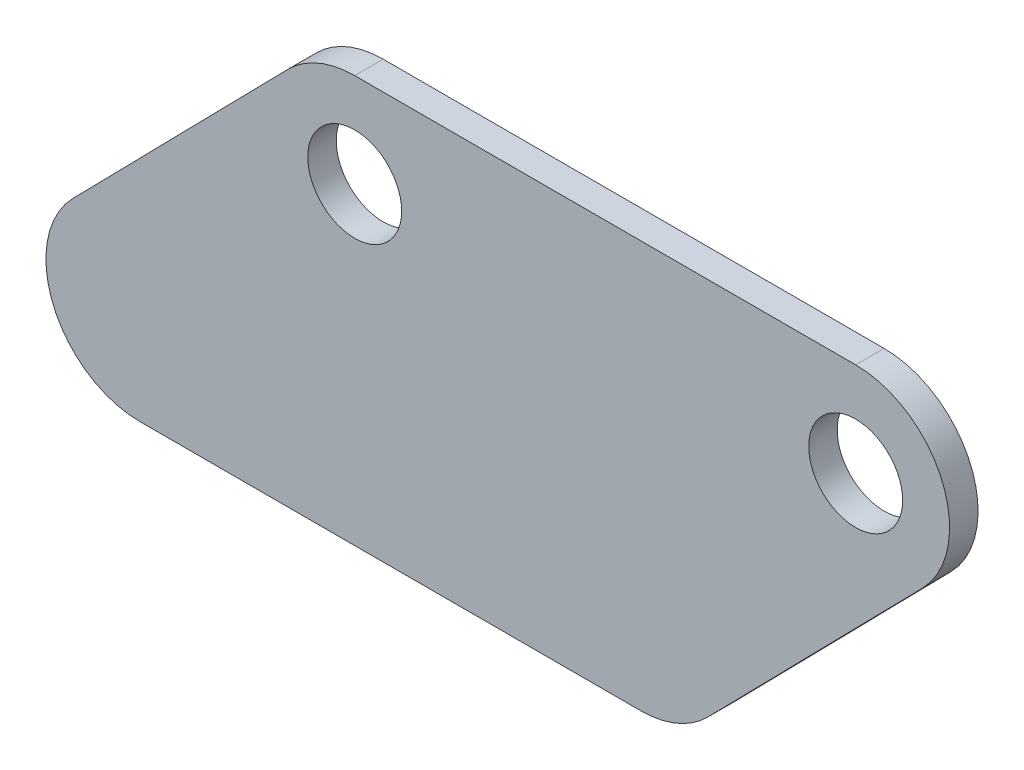
ISO-10303-21;
HEADER;
FILE_DESCRIPTION(('STEP AP214'),'2;1');
FILE_NAME('part.step','',(''),(''),'','','');
FILE_SCHEMA(('AUTOMOTIVE_DESIGN { 1 0 10303 214 1 1 1 1 }'));
ENDSEC;
DATA;
#1=APPLICATION_CONTEXT('core data for automotive mechanical design processes');
#2=APPLICATION_PROTOCOL_DEFINITION('international standard','automotive_design',2000,#1);
#3=PRODUCT_CONTEXT('',#1,'mechanical');
#4=PRODUCT('Part','Part','',(#3));
#5=PRODUCT_RELATED_PRODUCT_CATEGORY('part','',(#4));
#6=PRODUCT_DEFINITION_FORMATION('','',#4);
#7=PRODUCT_DEFINITION_CONTEXT('part definition',#1,'design');
#8=PRODUCT_DEFINITION('design','',#6,#7);
#9=PRODUCT_DEFINITION_SHAPE('','',#8);
#10=(LENGTH_UNIT() NAMED_UNIT(*) SI_UNIT(.MILLI.,.METRE.));
#11=(NAMED_UNIT(*) PLANE_ANGLE_UNIT() SI_UNIT($,.RADIAN.));
#12=(NAMED_UNIT(*) SI_UNIT($,.STERADIAN.) SOLID_ANGLE_UNIT());
#13=UNCERTAINTY_MEASURE_WITH_UNIT(LENGTH_MEASURE(1.E-05),#10,'distance_accuracy_value','');
#14=(GEOMETRIC_REPRESENTATION_CONTEXT(3) GLOBAL_UNCERTAINTY_ASSIGNED_CONTEXT((#13)) GLOBAL_UNIT_ASSIGNED_CONTEXT((#10,
#11,#12)) REPRESENTATION_CONTEXT('',''));
#15=CARTESIAN_POINT('',(0.,0.,0.));
#16=DIRECTION('',(0.,0.,1.));
#17=DIRECTION('',(1.,0.,0.));
#18=AXIS2_PLACEMENT_3D('',#15,#16,#17);
#19=CARTESIAN_POINT('',(0.,10.4775,3.175));
#20=DIRECTION('',(0.,1.,0.));
#21=DIRECTION('',(-1.,0.,0.));
#22=AXIS2_PLACEMENT_3D('',#19,#20,#21);
#23=PLANE('',#22);
#24=DIRECTION('',(1.,0.,0.));
#25=VECTOR('',#24,1.);
#26=CARTESIAN_POINT('',(0.,10.4775,0.));
#27=LINE('',#26,#25);
#28=CARTESIAN_POINT('',(6.25579670329671,10.4775,0.));
#29=VERTEX_POINT('',#28);
#30=CARTESIAN_POINT('',(62.1357967032967,10.4775,0.));
#31=VERTEX_POINT('',#30);
#32=EDGE_CURVE('E136',#29,#31,#27,.T.);
#33=ORIENTED_EDGE('',*,*,#32,.F.);
#34=DIRECTION('',(0.,0.,-1.));
#35=VECTOR('',#34,1.);
#36=CARTESIAN_POINT('',(6.25579670329671,10.4775,3.175));
#37=LINE('',#36,#35);
#38=CARTESIAN_POINT('',(6.25579670329671,10.4775,3.175));
#39=VERTEX_POINT('',#38);
#40=EDGE_CURVE('E11',#39,#29,#37,.T.);
#41=ORIENTED_EDGE('',*,*,#40,.F.);
#42=DIRECTION('',(1.,0.,0.));
#43=VECTOR('',#42,1.);
#44=CARTESIAN_POINT('',(0.,10.4775,3.175));
#45=LINE('',#44,#43);
#46=CARTESIAN_POINT('',(62.1357967032967,10.4775,3.175));
#47=VERTEX_POINT('',#46);
#48=EDGE_CURVE('E160',#39,#47,#45,.T.);
#49=ORIENTED_EDGE('',*,*,#48,.T.);
#50=DIRECTION('',(0.,0.,-1.));
#51=VECTOR('',#50,1.);
#52=CARTESIAN_POINT('',(62.1357967032967,10.4775,3.175));
#53=LINE('',#52,#51);
#54=EDGE_CURVE('E86',#47,#31,#53,.T.);
#55=ORIENTED_EDGE('',*,*,#54,.T.);
#56=EDGE_LOOP('',(#33,#41,#49,#55));
#57=FACE_BOUND('',#56,.T.);
#58=ADVANCED_FACE('F36',(#57),#23,.T.);
#59=CARTESIAN_POINT('',(6.25579670329671,0.,3.175));
#60=DIRECTION('',(0.,0.,-1.));
#61=DIRECTION('',(-1.,0.,0.));
#62=AXIS2_PLACEMENT_3D('',#59,#60,#61);
#63=CYLINDRICAL_SURFACE('',#62,10.4775);
#64=CARTESIAN_POINT('',(6.25579670329671,0.,0.));
#65=DIRECTION('',(0.,0.,1.));
#66=DIRECTION('',(1.,0.,0.));
#67=AXIS2_PLACEMENT_3D('',#64,#65,#66);
#68=CIRCLE('',#67,10.4775);
#69=CARTESIAN_POINT('',(-1.22663493270906,7.33425,0.));
#70=VERTEX_POINT('',#69);
#71=EDGE_CURVE('E139',#29,#70,#68,.T.);
#72=ORIENTED_EDGE('',*,*,#71,.T.);
#73=DIRECTION('',(0.,0.,-1.));
#74=VECTOR('',#73,1.);
#75=CARTESIAN_POINT('',(-1.22663493270906,7.33425,3.175));
#76=LINE('',#75,#74);
#77=CARTESIAN_POINT('',(-1.22663493270906,7.33425,3.175));
#78=VERTEX_POINT('',#77);
#79=EDGE_CURVE('E44',#78,#70,#76,.T.);
#80=ORIENTED_EDGE('',*,*,#79,.F.);
#81=CARTESIAN_POINT('',(6.25579670329671,0.,3.175));
#82=DIRECTION('',(0.,0.,1.));
#83=DIRECTION('',(1.,0.,0.));
#84=AXIS2_PLACEMENT_3D('',#81,#82,#83);
#85=CIRCLE('',#84,10.4775);
#86=EDGE_CURVE('E189',#39,#78,#85,.T.);
#87=ORIENTED_EDGE('',*,*,#86,.F.);
#88=ORIENTED_EDGE('',*,*,#40,.T.);
#89=EDGE_LOOP('',(#72,#80,#87,#88));
#90=FACE_BOUND('',#89,.T.);
#91=ADVANCED_FACE('F193',(#90),#63,.T.);
#92=CARTESIAN_POINT('',(-4.29197531732445,4.20697729059246,3.175));
#93=DIRECTION('',(0.714142842854285,-0.7,0.));
#94=DIRECTION('',(0.7,0.714142842854285,0.));
#95=AXIS2_PLACEMENT_3D('',#92,#93,#94);
#96=PLANE('',#95);
#97=DIRECTION('',(-0.7,-0.714142842854285,0.));
#98=VECTOR('',#97,1.);
#99=CARTESIAN_POINT('',(-4.29197531732445,4.20697729059246,0.));
#100=LINE('',#99,#98);
#101=CARTESIAN_POINT('',(-25.1899780807014,-17.11325,0.));
#102=VERTEX_POINT('',#101);
#103=EDGE_CURVE('E141',#70,#102,#100,.T.);
#104=ORIENTED_EDGE('',*,*,#103,.T.);
#105=DIRECTION('',(0.,0.,-1.));
#106=VECTOR('',#105,1.);
#107=CARTESIAN_POINT('',(-25.1899780807014,-17.11325,3.175));
#108=LINE('',#107,#106);
#109=CARTESIAN_POINT('',(-25.1899780807014,-17.11325,3.175));
#110=VERTEX_POINT('',#109);
#111=EDGE_CURVE('E166',#110,#102,#108,.T.);
#112=ORIENTED_EDGE('',*,*,#111,.F.);
#113=DIRECTION('',(-0.7,-0.714142842854285,0.));
#114=VECTOR('',#113,1.);
#115=CARTESIAN_POINT('',(-4.29197531732445,4.20697729059246,3.175));
#116=LINE('',#115,#114);
#117=EDGE_CURVE('E175',#78,#110,#116,.T.);
#118=ORIENTED_EDGE('',*,*,#117,.F.);
#119=ORIENTED_EDGE('',*,*,#79,.T.);
#120=EDGE_LOOP('',(#104,#112,#118,#119));
#121=FACE_BOUND('',#120,.T.);
#122=ADVANCED_FACE('F173',(#121),#96,.F.);
#123=CARTESIAN_POINT('',(-17.7075464446956,-24.4475,3.175));
#124=DIRECTION('',(0.,0.,-1.));
#125=DIRECTION('',(-1.,0.,0.));
#126=AXIS2_PLACEMENT_3D('',#123,#124,#125);
#127=CYLINDRICAL_SURFACE('',#126,10.4775);
#128=CARTESIAN_POINT('',(-17.7075464446956,-24.4475,0.));
#129=DIRECTION('',(0.,0.,1.));
#130=DIRECTION('',(1.,0.,0.));
#131=AXIS2_PLACEMENT_3D('',#128,#129,#130);
#132=CIRCLE('',#131,10.4775);
#133=CARTESIAN_POINT('',(-17.7075464446956,-34.925,0.));
#134=VERTEX_POINT('',#133);
#135=EDGE_CURVE('E143',#102,#134,#132,.T.);
#136=ORIENTED_EDGE('',*,*,#135,.T.);
#137=DIRECTION('',(0.,0.,-1.));
#138=VECTOR('',#137,1.);
#139=CARTESIAN_POINT('',(-17.7075464446956,-34.925,3.175));
#140=LINE('',#139,#138);
#141=CARTESIAN_POINT('',(-17.7075464446956,-34.925,3.175));
#142=VERTEX_POINT('',#141);
#143=EDGE_CURVE('E164',#142,#134,#140,.T.);
#144=ORIENTED_EDGE('',*,*,#143,.F.);
#145=CARTESIAN_POINT('',(-17.7075464446956,-24.4475,3.175));
#146=DIRECTION('',(0.,0.,1.));
#147=DIRECTION('',(1.,0.,0.));
#148=AXIS2_PLACEMENT_3D('',#145,#146,#147);
#149=CIRCLE('',#148,10.4775);
#150=EDGE_CURVE('E187',#110,#142,#149,.T.);
#151=ORIENTED_EDGE('',*,*,#150,.F.);
#152=ORIENTED_EDGE('',*,*,#111,.T.);
#153=EDGE_LOOP('',(#136,#144,#151,#152));
#154=FACE_BOUND('',#153,.T.);
#155=ADVANCED_FACE('F185',(#154),#127,.T.);
#156=CARTESIAN_POINT('',(0.,-34.925,3.175));
#157=DIRECTION('',(0.,-1.,0.));
#158=DIRECTION('',(0.,0.,-1.));
#159=AXIS2_PLACEMENT_3D('',#156,#157,#158);
#160=PLANE('',#159);
#161=DIRECTION('',(-1.,0.,0.));
#162=VECTOR('',#161,1.);
#163=CARTESIAN_POINT('',(0.,-34.925,0.));
#164=LINE('',#163,#162);
#165=CARTESIAN_POINT('',(38.1724535553044,-34.925,0.));
#166=VERTEX_POINT('',#165);
#167=EDGE_CURVE('E146',#166,#134,#164,.T.);
#168=ORIENTED_EDGE('',*,*,#167,.F.);
#169=DIRECTION('',(0.,0.,-1.));
#170=VECTOR('',#169,1.);
#171=CARTESIAN_POINT('',(38.1724535553044,-34.925,3.175));
#172=LINE('',#171,#170);
#173=CARTESIAN_POINT('',(38.1724535553044,-34.925,3.175));
#174=VERTEX_POINT('',#173);
#175=EDGE_CURVE('E123',#174,#166,#172,.T.);
#176=ORIENTED_EDGE('',*,*,#175,.F.);
#177=DIRECTION('',(-1.,0.,0.));
#178=VECTOR('',#177,1.);
#179=CARTESIAN_POINT('',(0.,-34.925,3.175));
#180=LINE('',#179,#178);
#181=EDGE_CURVE('E112',#174,#142,#180,.T.);
#182=ORIENTED_EDGE('',*,*,#181,.T.);
#183=ORIENTED_EDGE('',*,*,#143,.T.);
#184=EDGE_LOOP('',(#168,#176,#182,#183));
#185=FACE_BOUND('',#184,.T.);
#186=ADVANCED_FACE('F203',(#185),#160,.T.);
#187=CARTESIAN_POINT('',(38.1724535553044,-24.4475,3.175));
#188=DIRECTION('',(0.,0.,-1.));
#189=DIRECTION('',(-1.,0.,0.));
#190=AXIS2_PLACEMENT_3D('',#187,#188,#189);
#191=CYLINDRICAL_SURFACE('',#190,10.4775);
#192=CARTESIAN_POINT('',(38.1724535553044,-24.4475,0.));
#193=DIRECTION('',(0.,0.,1.));
#194=DIRECTION('',(1.,0.,0.));
#195=AXIS2_PLACEMENT_3D('',#192,#193,#194);
#196=CIRCLE('',#195,10.4775);
#197=CARTESIAN_POINT('',(45.6548851913102,-31.78175,0.));
#198=VERTEX_POINT('',#197);
#199=EDGE_CURVE('E119',#166,#198,#196,.T.);
#200=ORIENTED_EDGE('',*,*,#199,.T.);
#201=DIRECTION('',(0.,0.,-1.));
#202=VECTOR('',#201,1.);
#203=CARTESIAN_POINT('',(45.6548851913102,-31.78175,3.175));
#204=LINE('',#203,#202);
#205=CARTESIAN_POINT('',(45.6548851913102,-31.78175,3.175));
#206=VERTEX_POINT('',#205);
#207=EDGE_CURVE('E116',#206,#198,#204,.T.);
#208=ORIENTED_EDGE('',*,*,#207,.F.);
#209=CARTESIAN_POINT('',(38.1724535553044,-24.4475,3.175));
#210=DIRECTION('',(0.,0.,1.));
#211=DIRECTION('',(1.,0.,0.));
#212=AXIS2_PLACEMENT_3D('',#209,#210,#211);
#213=CIRCLE('',#212,10.4775);
#214=EDGE_CURVE('E105',#174,#206,#213,.T.);
#215=ORIENTED_EDGE('',*,*,#214,.F.);
#216=ORIENTED_EDGE('',*,*,#175,.T.);
#217=EDGE_LOOP('',(#200,#208,#215,#216));
#218=FACE_BOUND('',#217,.T.);
#219=ADVANCED_FACE('F117',(#218),#191,.T.);
#220=CARTESIAN_POINT('',(39.1716879546871,-38.3959341504958,3.175));
#221=DIRECTION('',(0.714142842854285,-0.7,0.));
#222=DIRECTION('',(0.7,0.714142842854285,0.));
#223=AXIS2_PLACEMENT_3D('',#220,#221,#222);
#224=PLANE('',#223);
#225=DIRECTION('',(-0.7,-0.714142842854285,0.));
#226=VECTOR('',#225,1.);
#227=CARTESIAN_POINT('',(39.1716879546871,-38.3959341504958,0.));
#228=LINE('',#227,#226);
#229=CARTESIAN_POINT('',(69.6182283393025,-7.33425,0.));
#230=VERTEX_POINT('',#229);
#231=EDGE_CURVE('E150',#230,#198,#228,.T.);
#232=ORIENTED_EDGE('',*,*,#231,.F.);
#233=DIRECTION('',(0.,0.,-1.));
#234=VECTOR('',#233,1.);
#235=CARTESIAN_POINT('',(69.6182283393025,-7.33425,3.175));
#236=LINE('',#235,#234);
#237=CARTESIAN_POINT('',(69.6182283393025,-7.33425,3.175));
#238=VERTEX_POINT('',#237);
#239=EDGE_CURVE('E79',#238,#230,#236,.T.);
#240=ORIENTED_EDGE('',*,*,#239,.F.);
#241=DIRECTION('',(-0.7,-0.714142842854285,0.));
#242=VECTOR('',#241,1.);
#243=CARTESIAN_POINT('',(39.1716879546871,-38.3959341504958,3.175));
#244=LINE('',#243,#242);
#245=EDGE_CURVE('E110',#238,#206,#244,.T.);
#246=ORIENTED_EDGE('',*,*,#245,.T.);
#247=ORIENTED_EDGE('',*,*,#207,.T.);
#248=EDGE_LOOP('',(#232,#240,#246,#247));
#249=FACE_BOUND('',#248,.T.);
#250=ADVANCED_FACE('F125',(#249),#224,.T.);
#251=CARTESIAN_POINT('',(6.25579670329671,0.,3.175));
#252=DIRECTION('',(0.,0.,-1.));
#253=DIRECTION('',(-1.,0.,0.));
#254=AXIS2_PLACEMENT_3D('',#251,#252,#253);
#255=CYLINDRICAL_SURFACE('',#254,5.23875);
#256=CARTESIAN_POINT('',(6.25579670329671,0.,3.175));
#257=DIRECTION('',(0.,0.,1.));
#258=DIRECTION('',(1.,0.,0.));
#259=AXIS2_PLACEMENT_3D('',#256,#257,#258);
#260=CIRCLE('',#259,5.23875);
#261=CARTESIAN_POINT('',(11.4945467032967,0.,3.175));
#262=VERTEX_POINT('',#261);
#263=EDGE_CURVE('E127',#262,#262,#260,.T.);
#264=ORIENTED_EDGE('',*,*,#263,.T.);
#265=EDGE_LOOP('',(#264));
#266=FACE_BOUND('',#265,.T.);
#267=CARTESIAN_POINT('',(6.25579670329671,0.,0.));
#268=DIRECTION('',(0.,0.,1.));
#269=DIRECTION('',(1.,0.,0.));
#270=AXIS2_PLACEMENT_3D('',#267,#268,#269);
#271=CIRCLE('',#270,5.23875);
#272=CARTESIAN_POINT('',(11.4945467032967,0.,0.));
#273=VERTEX_POINT('',#272);
#274=EDGE_CURVE('E154',#273,#273,#271,.T.);
#275=ORIENTED_EDGE('',*,*,#274,.F.);
#276=EDGE_LOOP('',(#275));
#277=FACE_BOUND('',#276,.T.);
#278=ADVANCED_FACE('F211',(#266,#277),#255,.F.);
#279=CARTESIAN_POINT('',(62.1357967032967,0.,3.175));
#280=DIRECTION('',(0.,0.,-1.));
#281=DIRECTION('',(-1.,0.,0.));
#282=AXIS2_PLACEMENT_3D('',#279,#280,#281);
#283=CYLINDRICAL_SURFACE('',#282,10.4775);
#284=CARTESIAN_POINT('',(62.1357967032967,0.,0.));
#285=DIRECTION('',(0.,0.,1.));
#286=DIRECTION('',(1.,0.,0.));
#287=AXIS2_PLACEMENT_3D('',#284,#285,#286);
#288=CIRCLE('',#287,10.4775);
#289=EDGE_CURVE('E152',#230,#31,#288,.T.);
#290=ORIENTED_EDGE('',*,*,#289,.T.);
#291=ORIENTED_EDGE('',*,*,#54,.F.);
#292=CARTESIAN_POINT('',(62.1357967032967,0.,3.175));
#293=DIRECTION('',(0.,0.,1.));
#294=DIRECTION('',(1.,0.,0.));
#295=AXIS2_PLACEMENT_3D('',#292,#293,#294);
#296=CIRCLE('',#295,10.4775);
#297=EDGE_CURVE('E52',#238,#47,#296,.T.);
#298=ORIENTED_EDGE('',*,*,#297,.F.);
#299=ORIENTED_EDGE('',*,*,#239,.T.);
#300=EDGE_LOOP('',(#290,#291,#298,#299));
#301=FACE_BOUND('',#300,.T.);
#302=ADVANCED_FACE('F212',(#301),#283,.T.);
#303=CARTESIAN_POINT('',(62.1357967032967,0.,3.175));
#304=DIRECTION('',(0.,0.,-1.));
#305=DIRECTION('',(-1.,0.,0.));
#306=AXIS2_PLACEMENT_3D('',#303,#304,#305);
#307=CYLINDRICAL_SURFACE('',#306,5.23875);
#308=CARTESIAN_POINT('',(62.1357967032967,0.,3.175));
#309=DIRECTION('',(0.,0.,1.));
#310=DIRECTION('',(1.,0.,0.));
#311=AXIS2_PLACEMENT_3D('',#308,#309,#310);
#312=CIRCLE('',#311,5.23875);
#313=CARTESIAN_POINT('',(67.3745467032967,0.,3.175));
#314=VERTEX_POINT('',#313);
#315=EDGE_CURVE('E133',#314,#314,#312,.T.);
#316=ORIENTED_EDGE('',*,*,#315,.T.);
#317=EDGE_LOOP('',(#316));
#318=FACE_BOUND('',#317,.T.);
#319=CARTESIAN_POINT('',(62.1357967032967,0.,0.));
#320=DIRECTION('',(0.,0.,1.));
#321=DIRECTION('',(1.,0.,0.));
#322=AXIS2_PLACEMENT_3D('',#319,#320,#321);
#323=CIRCLE('',#322,5.23875);
#324=CARTESIAN_POINT('',(67.3745467032967,0.,0.));
#325=VERTEX_POINT('',#324);
#326=EDGE_CURVE('E157',#325,#325,#323,.T.);
#327=ORIENTED_EDGE('',*,*,#326,.F.);
#328=EDGE_LOOP('',(#327));
#329=FACE_BOUND('',#328,.T.);
#330=ADVANCED_FACE('F215',(#318,#329),#307,.F.);
#331=CARTESIAN_POINT('',(0.,0.,3.175));
#332=DIRECTION('',(0.,0.,1.));
#333=DIRECTION('',(1.,0.,0.));
#334=AXIS2_PLACEMENT_3D('',#331,#332,#333);
#335=PLANE('',#334);
#336=ORIENTED_EDGE('',*,*,#48,.F.);
#337=ORIENTED_EDGE('',*,*,#86,.T.);
#338=ORIENTED_EDGE('',*,*,#117,.T.);
#339=ORIENTED_EDGE('',*,*,#150,.T.);
#340=ORIENTED_EDGE('',*,*,#181,.F.);
#341=ORIENTED_EDGE('',*,*,#214,.T.);
#342=ORIENTED_EDGE('',*,*,#245,.F.);
#343=ORIENTED_EDGE('',*,*,#297,.T.);
#344=EDGE_LOOP('',(#336,#337,#338,#339,#340,#341,#342,#343));
#345=FACE_BOUND('',#344,.T.);
#346=ORIENTED_EDGE('',*,*,#263,.F.);
#347=EDGE_LOOP('',(#346));
#348=FACE_BOUND('',#347,.T.);
#349=ORIENTED_EDGE('',*,*,#315,.F.);
#350=EDGE_LOOP('',(#349));
#351=FACE_BOUND('',#350,.T.);
#352=ADVANCED_FACE('F107',(#345,#348,#351),#335,.T.);
#353=CARTESIAN_POINT('',(0.,0.,0.));
#354=DIRECTION('',(0.,0.,1.));
#355=DIRECTION('',(1.,0.,0.));
#356=AXIS2_PLACEMENT_3D('',#353,#354,#355);
#357=PLANE('',#356);
#358=ORIENTED_EDGE('',*,*,#32,.T.);
#359=ORIENTED_EDGE('',*,*,#289,.F.);
#360=ORIENTED_EDGE('',*,*,#231,.T.);
#361=ORIENTED_EDGE('',*,*,#199,.F.);
#362=ORIENTED_EDGE('',*,*,#167,.T.);
#363=ORIENTED_EDGE('',*,*,#135,.F.);
#364=ORIENTED_EDGE('',*,*,#103,.F.);
#365=ORIENTED_EDGE('',*,*,#71,.F.);
#366=EDGE_LOOP('',(#358,#359,#360,#361,#362,#363,#364,#365));
#367=FACE_BOUND('',#366,.T.);
#368=ORIENTED_EDGE('',*,*,#274,.T.);
#369=EDGE_LOOP('',(#368));
#370=FACE_BOUND('',#369,.T.);
#371=ORIENTED_EDGE('',*,*,#326,.T.);
#372=EDGE_LOOP('',(#371));
#373=FACE_BOUND('',#372,.T.);
#374=ADVANCED_FACE('F180',(#367,#370,#373),#357,.F.);
#375=CLOSED_SHELL('',(#58,#91,#122,#155,#186,#219,#250,#278,#302,#330,#352,#374));
#376=MANIFOLD_SOLID_BREP('B2',#375);
#377=ADVANCED_BREP_SHAPE_REPRESENTATION('',(#18,#376),#14);
#378=SHAPE_DEFINITION_REPRESENTATION(#9,#377);
ENDSEC;
END-ISO-10303-21;
